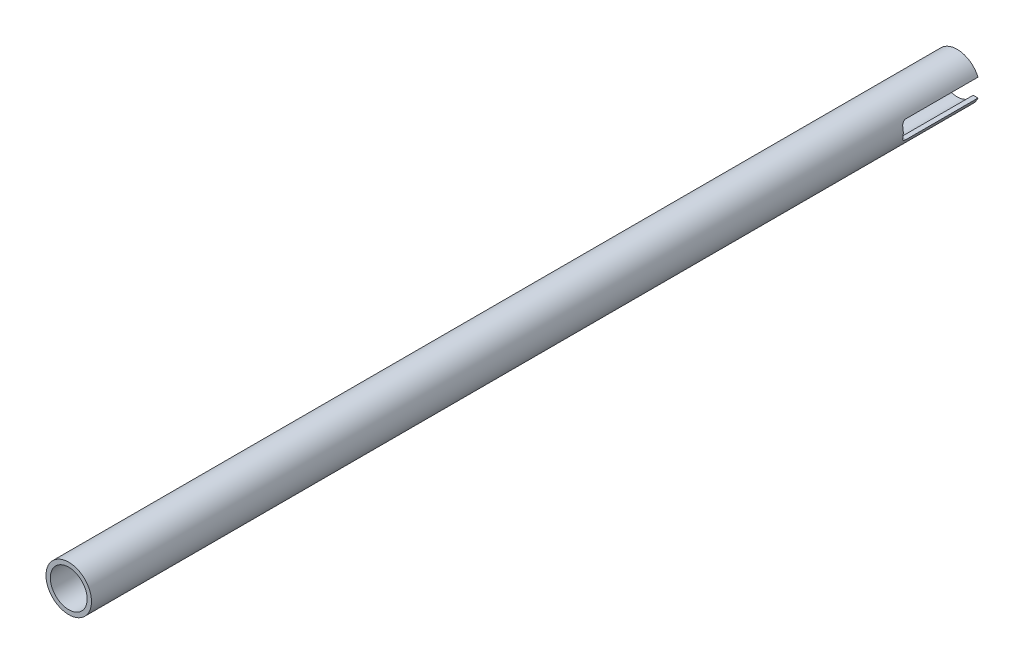
ISO-10303-21;
HEADER;
FILE_DESCRIPTION(('STEP AP214'),'2;1');
FILE_NAME('part.step','',(''),(''),'','','');
FILE_SCHEMA(('AUTOMOTIVE_DESIGN { 1 0 10303 214 1 1 1 1 }'));
ENDSEC;
DATA;
#1=APPLICATION_CONTEXT('core data for automotive mechanical design processes');
#2=APPLICATION_PROTOCOL_DEFINITION('international standard','automotive_design',2000,#1);
#3=PRODUCT_CONTEXT('',#1,'mechanical');
#4=PRODUCT('Part','Part','',(#3));
#5=PRODUCT_RELATED_PRODUCT_CATEGORY('part','',(#4));
#6=PRODUCT_DEFINITION_FORMATION('','',#4);
#7=PRODUCT_DEFINITION_CONTEXT('part definition',#1,'design');
#8=PRODUCT_DEFINITION('design','',#6,#7);
#9=PRODUCT_DEFINITION_SHAPE('','',#8);
#10=(LENGTH_UNIT() NAMED_UNIT(*) SI_UNIT(.MILLI.,.METRE.));
#11=(NAMED_UNIT(*) PLANE_ANGLE_UNIT() SI_UNIT($,.RADIAN.));
#12=(NAMED_UNIT(*) SI_UNIT($,.STERADIAN.) SOLID_ANGLE_UNIT());
#13=UNCERTAINTY_MEASURE_WITH_UNIT(LENGTH_MEASURE(1.E-05),#10,'distance_accuracy_value','');
#14=(GEOMETRIC_REPRESENTATION_CONTEXT(3) GLOBAL_UNCERTAINTY_ASSIGNED_CONTEXT((#13)) GLOBAL_UNIT_ASSIGNED_CONTEXT((#10,
#11,#12)) REPRESENTATION_CONTEXT('',''));
#15=CARTESIAN_POINT('',(0.,0.,0.));
#16=DIRECTION('',(0.,0.,1.));
#17=DIRECTION('',(1.,0.,0.));
#18=AXIS2_PLACEMENT_3D('',#15,#16,#17);
#19=CARTESIAN_POINT('',(0.,0.,0.));
#20=DIRECTION('',(0.,0.,1.));
#21=DIRECTION('',(1.,0.,0.));
#22=AXIS2_PLACEMENT_3D('',#19,#20,#21);
#23=PLANE('',#22);
#24=DIRECTION('',(-1.,0.,0.));
#25=VECTOR('',#24,1.);
#26=CARTESIAN_POINT('',(401.549427926421,-3.17500000000001,0.));
#27=LINE('',#26,#25);
#28=CARTESIAN_POINT('',(7.34407080575888,-3.17500000000001,0.));
#29=VERTEX_POINT('',#28);
#30=CARTESIAN_POINT('',(5.64543213580679,-3.17500000000001,0.));
#31=VERTEX_POINT('',#30);
#32=EDGE_CURVE('E57',#29,#31,#27,.T.);
#33=ORIENTED_EDGE('',*,*,#32,.F.);
#34=CARTESIAN_POINT('',(0.,0.,0.));
#35=DIRECTION('',(0.,0.,1.));
#36=DIRECTION('',(1.,0.,0.));
#37=AXIS2_PLACEMENT_3D('',#34,#35,#36);
#38=CIRCLE('',#37,8.001);
#39=CARTESIAN_POINT('',(-7.34407080575888,-3.17500000000001,0.));
#40=VERTEX_POINT('',#39);
#41=EDGE_CURVE('E146',#40,#29,#38,.T.);
#42=ORIENTED_EDGE('',*,*,#41,.F.);
#43=CARTESIAN_POINT('',(-5.64543213580676,-3.17500000000001,0.));
#44=VERTEX_POINT('',#43);
#45=EDGE_CURVE('E140',#44,#40,#27,.T.);
#46=ORIENTED_EDGE('',*,*,#45,.F.);
#47=CARTESIAN_POINT('',(0.,0.,0.));
#48=DIRECTION('',(0.,0.,1.));
#49=DIRECTION('',(1.,0.,0.));
#50=AXIS2_PLACEMENT_3D('',#47,#48,#49);
#51=CIRCLE('',#50,6.477);
#52=EDGE_CURVE('E242',#44,#31,#51,.T.);
#53=ORIENTED_EDGE('',*,*,#52,.T.);
#54=EDGE_LOOP('',(#33,#42,#46,#53));
#55=FACE_BOUND('',#54,.T.);
#56=ADVANCED_FACE('F33',(#55),#23,.F.);
#57=CARTESIAN_POINT('',(0.,0.,312.42));
#58=DIRECTION('',(0.,0.,-1.));
#59=DIRECTION('',(-1.,0.,0.));
#60=AXIS2_PLACEMENT_3D('',#57,#58,#59);
#61=CYLINDRICAL_SURFACE('',#60,8.001);
#62=CARTESIAN_POINT('',(0.,0.,312.42));
#63=DIRECTION('',(0.,0.,1.));
#64=DIRECTION('',(1.,0.,0.));
#65=AXIS2_PLACEMENT_3D('',#62,#63,#64);
#66=CIRCLE('',#65,8.001);
#67=CARTESIAN_POINT('',(8.001,0.,312.42));
#68=VERTEX_POINT('',#67);
#69=EDGE_CURVE('E249',#68,#68,#66,.T.);
#70=ORIENTED_EDGE('',*,*,#69,.F.);
#71=EDGE_LOOP('',(#70));
#72=FACE_BOUND('',#71,.T.);
#73=DIRECTION('',(0.,0.,-1.));
#74=VECTOR('',#73,1.);
#75=CARTESIAN_POINT('',(7.34407080575893,3.17499999999989,312.42));
#76=LINE('',#75,#74);
#77=CARTESIAN_POINT('',(7.34407080575894,3.175,0.));
#78=VERTEX_POINT('',#77);
#79=CARTESIAN_POINT('',(7.34407080575889,3.17499999999999,25.4));
#80=VERTEX_POINT('',#79);
#81=EDGE_CURVE('E238',#78,#80,#76,.F.);
#82=ORIENTED_EDGE('',*,*,#81,.F.);
#83=CARTESIAN_POINT('',(-7.34407080575894,3.175,0.));
#84=VERTEX_POINT('',#83);
#85=EDGE_CURVE('E253',#78,#84,#38,.T.);
#86=ORIENTED_EDGE('',*,*,#85,.T.);
#87=DIRECTION('',(0.,0.,-1.));
#88=VECTOR('',#87,1.);
#89=CARTESIAN_POINT('',(-7.34407080575893,3.17499999999989,312.42));
#90=LINE('',#89,#88);
#91=CARTESIAN_POINT('',(-7.34407080575889,3.17499999999999,25.4));
#92=VERTEX_POINT('',#91);
#93=EDGE_CURVE('E240',#92,#84,#90,.T.);
#94=ORIENTED_EDGE('',*,*,#93,.F.);
#95=CARTESIAN_POINT('',(-7.8288057837706,1.65099999999999,26.924));
#96=CARTESIAN_POINT('',(-7.81947795268345,1.69524181564514,26.9239996807889));
#97=CARTESIAN_POINT('',(-7.80977555287386,1.73937906238704,26.9220725755956));
#98=CARTESIAN_POINT('',(-7.7897053190962,1.82715995012294,26.9144259194222));
#99=CARTESIAN_POINT('',(-7.77933765259943,1.870803712116,26.9087073195399));
#100=CARTESIAN_POINT('',(-7.74740781787862,2.00038689143379,26.8859920832168));
#101=CARTESIAN_POINT('',(-7.72497172734663,2.08520038066885,26.8634353611242));
#102=CARTESIAN_POINT('',(-7.67879255624773,2.24931803273243,26.8043529357356));
#103=CARTESIAN_POINT('',(-7.65505009243317,2.32862475603218,26.767833776622));
#104=CARTESIAN_POINT('',(-7.60739952527334,2.47987144136615,26.6818403935313));
#105=CARTESIAN_POINT('',(-7.58349136309819,2.55180862700726,26.6323613118312));
#106=CARTESIAN_POINT('',(-7.53640113822511,2.68773877112478,26.5205553900397));
#107=CARTESIAN_POINT('',(-7.51324222932275,2.75155008701076,26.4579974672164));
#108=CARTESIAN_POINT('',(-7.46969556535498,2.86766507697725,26.3221080561482));
#109=CARTESIAN_POINT('',(-7.44930787514765,2.91996848174228,26.2487763158346));
#110=CARTESIAN_POINT('',(-7.41339882631975,3.00995182097469,26.095356056821));
#111=CARTESIAN_POINT('',(-7.39775949227146,3.04799299625044,26.015507568052));
#112=CARTESIAN_POINT('',(-7.37198636942665,3.10981595853761,25.8496963126839));
#113=CARTESIAN_POINT('',(-7.36184321814924,3.13362200161646,25.7637442276388));
#114=CARTESIAN_POINT('',(-7.35134082404798,3.15814271182933,25.630748149592));
#115=CARTESIAN_POINT('',(-7.34862226710174,3.16445643648463,25.5848527548858));
#116=CARTESIAN_POINT('',(-7.34498545577234,3.17288497032065,25.4926477775769));
#117=CARTESIAN_POINT('',(-7.34406565426136,3.17500338794749,25.4463385853611));
#118=CARTESIAN_POINT('',(-7.34407080575889,3.17499999999999,25.4));
#119=B_SPLINE_CURVE_WITH_KNOTS('',3,(#95,#96,#97,#98,#99,#100,#101,#102,#103,#104,#105,#106,
#107,#108,#109,#110,#111,#112,#113,#114,#115,#116,#117,#118),.UNSPECIFIED.,.F.,.F.,(4,2,2,2,2,2,
2,2,2,2,2,4),(0.,0.135553024626245,0.271072058592374,0.541437670457961,0.811676717226673,
1.082017202076,1.35761362878683,1.63321650449497,1.90127196271359,2.16886935439238,
2.30789050122071,2.4467920218655),.UNSPECIFIED.);
#120=CARTESIAN_POINT('',(-7.8288057837706,1.65099999999999,26.924));
#121=VERTEX_POINT('',#120);
#122=EDGE_CURVE('E226',#121,#92,#119,.T.);
#123=ORIENTED_EDGE('',*,*,#122,.F.);
#124=CARTESIAN_POINT('',(0.,0.,26.924));
#125=DIRECTION('',(0.,0.,-1.));
#126=DIRECTION('',(-1.,0.,0.));
#127=AXIS2_PLACEMENT_3D('',#124,#125,#126);
#128=CIRCLE('',#127,8.001);
#129=CARTESIAN_POINT('',(-7.8288057837706,-1.65100000000001,26.924));
#130=VERTEX_POINT('',#129);
#131=EDGE_CURVE('E134',#130,#121,#128,.T.);
#132=ORIENTED_EDGE('',*,*,#131,.F.);
#133=CARTESIAN_POINT('',(-7.34407080575888,-3.17500000000001,25.4));
#134=CARTESIAN_POINT('',(-7.3440680096913,-3.17500157818639,25.4406984476088));
#135=CARTESIAN_POINT('',(-7.34477630214677,-3.17336860893187,25.4813759502433));
#136=CARTESIAN_POINT('',(-7.34758309143992,-3.16686635956913,25.562411407968));
#137=CARTESIAN_POINT('',(-7.34968118035477,-3.16199802907896,25.6027694533067));
#138=CARTESIAN_POINT('',(-7.35798857580184,-3.14264423927033,25.7226338560667));
#139=CARTESIAN_POINT('',(-7.36621159330718,-3.12340930879257,25.8012906881812));
#140=CARTESIAN_POINT('',(-7.38735918413182,-3.07305366060584,25.9538993996992));
#141=CARTESIAN_POINT('',(-7.40028060607282,-3.0419409090553,26.027854393813));
#142=CARTESIAN_POINT('',(-7.4298815779994,-2.96890708335138,26.1694453435949));
#143=CARTESIAN_POINT('',(-7.44656372650464,-2.92697853298673,26.2370768840646));
#144=CARTESIAN_POINT('',(-7.48338951433548,-2.83153727514408,26.3673193992744));
#145=CARTESIAN_POINT('',(-7.5036517696014,-2.77760154335606,26.4295861247467));
#146=CARTESIAN_POINT('',(-7.54586923311684,-2.66077336101834,26.5443978381578));
#147=CARTESIAN_POINT('',(-7.56782510086072,-2.59787741319581,26.5969390116058));
#148=CARTESIAN_POINT('',(-7.61377353576087,-2.46009532987572,26.69442490565));
#149=CARTESIAN_POINT('',(-7.63780327629239,-2.38468542927396,26.738613263246));
#150=CARTESIAN_POINT('',(-7.68517828309943,-2.22728162943213,26.8135295949975));
#151=CARTESIAN_POINT('',(-7.70852388215322,-2.14529100625114,26.8442642181981));
#152=CARTESIAN_POINT('',(-7.74866065435345,-1.99473307846589,26.8863269168587));
#153=CARTESIAN_POINT('',(-7.76579152458538,-1.9270088220366,26.9003889784846));
#154=CARTESIAN_POINT('',(-7.79853598216448,-1.78994063052703,26.9192336722557));
#155=CARTESIAN_POINT('',(-7.81414985826825,-1.7205970068191,26.9240180736839));
#156=CARTESIAN_POINT('',(-7.8288057837706,-1.65100000000001,26.924));
#157=B_SPLINE_CURVE_WITH_KNOTS('',3,(#133,#134,#135,#136,#137,#138,#139,#140,#141,#142,#143,
#144,#145,#146,#147,#148,#149,#150,#151,#152,#153,#154,#155,#156),.UNSPECIFIED.,.F.,.F.,(4,2,2,
2,2,2,2,2,2,2,2,4),(0.,0.12201561431295,0.243995431359554,0.486888996424004,0.729619944201783,
0.972519126749111,1.22593711832599,1.47945429417213,1.75015649231413,2.02072475374975,
2.23388433321154,2.44700325838137),.UNSPECIFIED.);
#158=CARTESIAN_POINT('',(-7.34407080575888,-3.17500000000001,25.4));
#159=VERTEX_POINT('',#158);
#160=EDGE_CURVE('E135',#159,#130,#157,.T.);
#161=ORIENTED_EDGE('',*,*,#160,.F.);
#162=DIRECTION('',(0.,0.,-1.));
#163=VECTOR('',#162,1.);
#164=CARTESIAN_POINT('',(-7.34407080575888,-3.17500000000001,312.42));
#165=LINE('',#164,#163);
#166=EDGE_CURVE('E147',#40,#159,#165,.F.);
#167=ORIENTED_EDGE('',*,*,#166,.F.);
#168=ORIENTED_EDGE('',*,*,#41,.T.);
#169=DIRECTION('',(0.,0.,-1.));
#170=VECTOR('',#169,1.);
#171=CARTESIAN_POINT('',(7.34407080575888,-3.17500000000001,312.42));
#172=LINE('',#171,#170);
#173=CARTESIAN_POINT('',(7.34407080575888,-3.17500000000001,25.4));
#174=VERTEX_POINT('',#173);
#175=EDGE_CURVE('E138',#174,#29,#172,.T.);
#176=ORIENTED_EDGE('',*,*,#175,.F.);
#177=CARTESIAN_POINT('',(7.8288057837706,-1.65100000000001,26.924));
#178=CARTESIAN_POINT('',(7.81947795268344,-1.69524181564516,26.9239996807889));
#179=CARTESIAN_POINT('',(7.80977555287386,-1.73937906238705,26.9220725755956));
#180=CARTESIAN_POINT('',(7.78970531909619,-1.82715995012296,26.9144259194222));
#181=CARTESIAN_POINT('',(7.77933765259943,-1.87080371211602,26.9087073195399));
#182=CARTESIAN_POINT('',(7.74740781787862,-2.00038689143381,26.8859920832168));
#183=CARTESIAN_POINT('',(7.72497172734662,-2.08520038066886,26.8634353611242));
#184=CARTESIAN_POINT('',(7.67879255624773,-2.24931803273245,26.8043529357356));
#185=CARTESIAN_POINT('',(7.65505009243317,-2.3286247560322,26.767833776622));
#186=CARTESIAN_POINT('',(7.60739952527334,-2.47987144136616,26.6818403935313));
#187=CARTESIAN_POINT('',(7.58349136309818,-2.55180862700728,26.6323613118312));
#188=CARTESIAN_POINT('',(7.5364011382251,-2.6877387711248,26.5205553900397));
#189=CARTESIAN_POINT('',(7.51324222932275,-2.75155008701078,26.4579974672164));
#190=CARTESIAN_POINT('',(7.46969556535497,-2.86766507697726,26.3221080561482));
#191=CARTESIAN_POINT('',(7.44930787514765,-2.9199684817423,26.2487763158346));
#192=CARTESIAN_POINT('',(7.41339882631974,-3.00995182097471,26.095356056821));
#193=CARTESIAN_POINT('',(7.39775949227145,-3.04799299625045,26.015507568052));
#194=CARTESIAN_POINT('',(7.37198636942665,-3.10981595853763,25.8496963126839));
#195=CARTESIAN_POINT('',(7.36184321814923,-3.13362200161648,25.7637442276388));
#196=CARTESIAN_POINT('',(7.35134082404797,-3.15814271182935,25.630748149592));
#197=CARTESIAN_POINT('',(7.34862226710173,-3.16445643648465,25.5848527548858));
#198=CARTESIAN_POINT('',(7.34498545577233,-3.17288497032067,25.4926477775769));
#199=CARTESIAN_POINT('',(7.34406565426135,-3.17500338794751,25.4463385853611));
#200=CARTESIAN_POINT('',(7.34407080575888,-3.17500000000001,25.4));
#201=B_SPLINE_CURVE_WITH_KNOTS('',3,(#177,#178,#179,#180,#181,#182,#183,#184,#185,#186,#187,
#188,#189,#190,#191,#192,#193,#194,#195,#196,#197,#198,#199,#200),.UNSPECIFIED.,.F.,.F.,(4,2,2,
2,2,2,2,2,2,2,2,4),(0.,0.135553024626244,0.271072058592373,0.541437670457961,0.811676717226673,
1.082017202076,1.35761362878683,1.63321650449497,1.90127196271359,2.16886935439238,
2.3078905012207,2.4467920218655),.UNSPECIFIED.);
#202=CARTESIAN_POINT('',(7.8288057837706,-1.65100000000001,26.924));
#203=VERTEX_POINT('',#202);
#204=EDGE_CURVE('E124',#203,#174,#201,.T.);
#205=ORIENTED_EDGE('',*,*,#204,.F.);
#206=CARTESIAN_POINT('',(7.8288057837706,1.65099999999999,26.924));
#207=VERTEX_POINT('',#206);
#208=EDGE_CURVE('E232',#207,#203,#128,.T.);
#209=ORIENTED_EDGE('',*,*,#208,.F.);
#210=CARTESIAN_POINT('',(7.34407080575889,3.17499999999999,25.4));
#211=CARTESIAN_POINT('',(7.34406800969131,3.17500157818637,25.4406984476088));
#212=CARTESIAN_POINT('',(7.34477630214678,3.17336860893186,25.4813759502433));
#213=CARTESIAN_POINT('',(7.34758309143993,3.16686635956911,25.562411407968));
#214=CARTESIAN_POINT('',(7.34968118035478,3.16199802907895,25.6027694533067));
#215=CARTESIAN_POINT('',(7.35798857580184,3.14264423927032,25.7226338560667));
#216=CARTESIAN_POINT('',(7.36621159330719,3.12340930879256,25.8012906881812));
#217=CARTESIAN_POINT('',(7.38735918413182,3.07305366060582,25.9538993996992));
#218=CARTESIAN_POINT('',(7.40028060607282,3.04194090905528,26.027854393813));
#219=CARTESIAN_POINT('',(7.4298815779994,2.96890708335136,26.1694453435949));
#220=CARTESIAN_POINT('',(7.44656372650465,2.92697853298671,26.2370768840646));
#221=CARTESIAN_POINT('',(7.48338951433549,2.83153727514406,26.3673193992745));
#222=CARTESIAN_POINT('',(7.50365176960141,2.77760154335604,26.4295861247467));
#223=CARTESIAN_POINT('',(7.54586923311684,2.66077336101832,26.5443978381578));
#224=CARTESIAN_POINT('',(7.56782510086072,2.5978774131958,26.5969390116058));
#225=CARTESIAN_POINT('',(7.61377353576087,2.4600953298757,26.69442490565));
#226=CARTESIAN_POINT('',(7.6378032762924,2.38468542927395,26.738613263246));
#227=CARTESIAN_POINT('',(7.68517828309944,2.22728162943211,26.8135295949975));
#228=CARTESIAN_POINT('',(7.70852388215323,2.14529100625113,26.8442642181981));
#229=CARTESIAN_POINT('',(7.74866065435345,1.99473307846587,26.8863269168587));
#230=CARTESIAN_POINT('',(7.76579152458538,1.92700882203658,26.9003889784846));
#231=CARTESIAN_POINT('',(7.79853598216448,1.78994063052701,26.9192336722557));
#232=CARTESIAN_POINT('',(7.81414985826825,1.72059700681908,26.9240180736839));
#233=CARTESIAN_POINT('',(7.8288057837706,1.65099999999999,26.924));
#234=B_SPLINE_CURVE_WITH_KNOTS('',3,(#210,#211,#212,#213,#214,#215,#216,#217,#218,#219,#220,
#221,#222,#223,#224,#225,#226,#227,#228,#229,#230,#231,#232,#233),.UNSPECIFIED.,.F.,.F.,(4,2,2,
2,2,2,2,2,2,2,2,4),(0.,0.12201561431295,0.243995431359554,0.486888996424004,0.729619944201783,
0.972519126749115,1.225937118326,1.47945429417213,1.75015649231413,2.02072475374975,
2.23388433321155,2.44700325838137),.UNSPECIFIED.);
#235=EDGE_CURVE('E231',#80,#207,#234,.T.);
#236=ORIENTED_EDGE('',*,*,#235,.F.);
#237=EDGE_LOOP('',(#82,#86,#94,#123,#132,#161,#167,#168,#176,#205,#209,#236));
#238=FACE_BOUND('',#237,.T.);
#239=ADVANCED_FACE('F35',(#72,#238),#61,.T.);
#240=CARTESIAN_POINT('',(0.,0.,312.42));
#241=DIRECTION('',(0.,0.,-1.));
#242=DIRECTION('',(-1.,0.,0.));
#243=AXIS2_PLACEMENT_3D('',#240,#241,#242);
#244=CYLINDRICAL_SURFACE('',#243,6.477);
#245=CARTESIAN_POINT('',(0.,0.,312.42));
#246=DIRECTION('',(0.,0.,1.));
#247=DIRECTION('',(1.,0.,0.));
#248=AXIS2_PLACEMENT_3D('',#245,#246,#247);
#249=CIRCLE('',#248,6.477);
#250=CARTESIAN_POINT('',(6.477,0.,312.42));
#251=VERTEX_POINT('',#250);
#252=EDGE_CURVE('E243',#251,#251,#249,.T.);
#253=ORIENTED_EDGE('',*,*,#252,.T.);
#254=EDGE_LOOP('',(#253));
#255=FACE_BOUND('',#254,.T.);
#256=CARTESIAN_POINT('',(5.64543213580687,3.175,0.));
#257=VERTEX_POINT('',#256);
#258=CARTESIAN_POINT('',(-5.64543213580687,3.175,0.));
#259=VERTEX_POINT('',#258);
#260=EDGE_CURVE('E246',#257,#259,#51,.T.);
#261=ORIENTED_EDGE('',*,*,#260,.F.);
#262=DIRECTION('',(0.,0.,-1.));
#263=VECTOR('',#262,1.);
#264=CARTESIAN_POINT('',(5.64543213580685,3.17499999999989,312.42));
#265=LINE('',#264,#263);
#266=CARTESIAN_POINT('',(5.64543213580679,3.17499999999999,25.4));
#267=VERTEX_POINT('',#266);
#268=EDGE_CURVE('E11',#257,#267,#265,.F.);
#269=ORIENTED_EDGE('',*,*,#268,.T.);
#270=CARTESIAN_POINT('',(5.64543213580679,3.17499999999999,25.4));
#271=CARTESIAN_POINT('',(5.64542798532432,3.17500253012491,25.4395022750384));
#272=CARTESIAN_POINT('',(5.64629676751123,3.17346305780188,25.4789831851797));
#273=CARTESIAN_POINT('',(5.64973489172762,3.16734010596934,25.557616333837));
#274=CARTESIAN_POINT('',(5.65230347216193,3.16275798971433,25.5967687115998));
#275=CARTESIAN_POINT('',(5.6624528235623,3.14457608288719,25.7129070155873));
#276=CARTESIAN_POINT('',(5.67247830845162,3.12653965087181,25.7890381879893));
#277=CARTESIAN_POINT('',(5.69814957474155,3.07950075965754,25.9366255007952));
#278=CARTESIAN_POINT('',(5.71378770060105,3.05051323473278,26.0080878532046));
#279=CARTESIAN_POINT('',(5.74949312759986,2.98267072120713,26.1450337996201));
#280=CARTESIAN_POINT('',(5.7695654342793,2.94380457356396,26.2105105176722));
#281=CARTESIAN_POINT('',(5.81427344287328,2.85454020484129,26.3383725064171));
#282=CARTESIAN_POINT('',(5.83912294015509,2.80355001313473,26.4002682413202));
#283=CARTESIAN_POINT('',(5.89090094280743,2.69305400468479,26.5149190340714));
#284=CARTESIAN_POINT('',(5.91783040535228,2.63354425646504,26.5676698468731));
#285=CARTESIAN_POINT('',(5.9754026920417,2.50037980782341,26.6683991647787));
#286=CARTESIAN_POINT('',(6.00613015030678,2.42589024924425,26.7152294493506));
#287=CARTESIAN_POINT('',(6.06685054178971,2.26977298542592,26.7954912659983));
#288=CARTESIAN_POINT('',(6.09684379767183,2.18814849062353,26.8289287868608));
#289=CARTESIAN_POINT('',(6.15068954263711,2.03135452128191,26.8777262918858));
#290=CARTESIAN_POINT('',(6.17481721444706,1.95685658409068,26.8949485076857));
#291=CARTESIAN_POINT('',(6.2208090046563,1.80539896583252,26.9181012531514));
#292=CARTESIAN_POINT('',(6.24267154884634,1.72843762073706,26.9240239790673));
#293=CARTESIAN_POINT('',(6.26304462701648,1.65099999999999,26.924));
#294=B_SPLINE_CURVE_WITH_KNOTS('',3,(#270,#271,#272,#273,#274,#275,#276,#277,#278,#279,#280,
#281,#282,#283,#284,#285,#286,#287,#288,#289,#290,#291,#292,#293),.UNSPECIFIED.,.F.,.F.,(4,2,2,
2,2,2,2,2,2,2,2,4),(0.,0.11842611788255,0.236799210795268,0.472172634307249,0.707226225252082,
0.942546525606806,1.19340365391803,1.44437691938388,1.72272641785955,2.00095130860679,
2.2406452178067,2.48050460661625),.UNSPECIFIED.);
#295=CARTESIAN_POINT('',(6.26304462701648,1.65099999999999,26.924));
#296=VERTEX_POINT('',#295);
#297=EDGE_CURVE('E42',#267,#296,#294,.T.);
#298=ORIENTED_EDGE('',*,*,#297,.T.);
#299=CARTESIAN_POINT('',(0.,0.,26.924));
#300=DIRECTION('',(0.,0.,-1.));
#301=DIRECTION('',(-1.,0.,0.));
#302=AXIS2_PLACEMENT_3D('',#299,#300,#301);
#303=CIRCLE('',#302,6.477);
#304=CARTESIAN_POINT('',(6.26304462701648,-1.65100000000001,26.924));
#305=VERTEX_POINT('',#304);
#306=EDGE_CURVE('E189',#296,#305,#303,.T.);
#307=ORIENTED_EDGE('',*,*,#306,.T.);
#308=CARTESIAN_POINT('',(6.26304462701648,-1.65100000000001,26.924));
#309=CARTESIAN_POINT('',(6.25119301356599,-1.69597019045452,26.9239996512927));
#310=CARTESIAN_POINT('',(6.23885805015263,-1.74078424361484,26.9220087653986));
#311=CARTESIAN_POINT('',(6.21333080831812,-1.82980515275706,26.914134138941));
#312=CARTESIAN_POINT('',(6.20013884930389,-1.87401222760585,26.9082518413061));
#313=CARTESIAN_POINT('',(6.15951133396886,-2.00506101361784,26.8849457970163));
#314=CARTESIAN_POINT('',(6.13094979172369,-2.09061085165535,26.8618617467996));
#315=CARTESIAN_POINT('',(6.07212151471613,-2.25578612168244,26.8016219603263));
#316=CARTESIAN_POINT('',(6.04185654214358,-2.33541748531392,26.7644805465843));
#317=CARTESIAN_POINT('',(5.98100165398782,-2.48713337520254,26.6771532445204));
#318=CARTESIAN_POINT('',(5.95041151302896,-2.55921223237762,26.6269576544588));
#319=CARTESIAN_POINT('',(5.88959770370069,-2.69629003214929,26.5127307014112));
#320=CARTESIAN_POINT('',(5.85942026108732,-2.76097278644596,26.4482938275107));
#321=CARTESIAN_POINT('',(5.80262181829033,-2.87843237174364,26.3079375307773));
#322=CARTESIAN_POINT('',(5.77600068690932,-2.93120964200446,26.2320185317567));
#323=CARTESIAN_POINT('',(5.72961508062245,-3.02084256755071,26.0738173863488));
#324=CARTESIAN_POINT('',(5.70961192114585,-3.05826802843452,25.9919300118511));
#325=CARTESIAN_POINT('',(5.67705818777086,-3.11828924116529,25.8215909438744));
#326=CARTESIAN_POINT('',(5.66448853762436,-3.14092296814996,25.7331567140417));
#327=CARTESIAN_POINT('',(5.65274801817815,-3.16196375608022,25.603042864781));
#328=CARTESIAN_POINT('',(5.65001234622036,-3.16684526064363,25.5626313476031));
#329=CARTESIAN_POINT('',(5.64635324825543,-3.17336296637714,25.4814890576694));
#330=CARTESIAN_POINT('',(5.64542881846813,-3.17500096508517,25.440758474312));
#331=CARTESIAN_POINT('',(5.64543213580678,-3.17500000000001,25.4));
#332=B_SPLINE_CURVE_WITH_KNOTS('',3,(#308,#309,#310,#311,#312,#313,#314,#315,#316,#317,#318,
#319,#320,#321,#322,#323,#324,#325,#326,#327,#328,#329,#330,#331),.UNSPECIFIED.,.F.,.F.,(4,2,2,
2,2,2,2,2,2,2,2,4),(0.,0.13941997674178,0.278788285754549,0.556665652257206,0.8342606588877,
1.11206256399923,1.39912695233711,1.68618074753331,1.9613229485987,2.23575596690122,
2.35800176569004,2.48017979736539),.UNSPECIFIED.);
#333=CARTESIAN_POINT('',(5.64543213580676,-3.17500000000001,25.4));
#334=VERTEX_POINT('',#333);
#335=EDGE_CURVE('E183',#305,#334,#332,.T.);
#336=ORIENTED_EDGE('',*,*,#335,.T.);
#337=DIRECTION('',(0.,0.,-1.));
#338=VECTOR('',#337,1.);
#339=CARTESIAN_POINT('',(5.64543213580679,-3.17500000000001,312.42));
#340=LINE('',#339,#338);
#341=EDGE_CURVE('E139',#334,#31,#340,.T.);
#342=ORIENTED_EDGE('',*,*,#341,.T.);
#343=ORIENTED_EDGE('',*,*,#52,.F.);
#344=DIRECTION('',(0.,0.,-1.));
#345=VECTOR('',#344,1.);
#346=CARTESIAN_POINT('',(-5.64543213580679,-3.17500000000001,312.42));
#347=LINE('',#346,#345);
#348=CARTESIAN_POINT('',(-5.64543213580679,-3.17500000000001,25.4));
#349=VERTEX_POINT('',#348);
#350=EDGE_CURVE('E252',#44,#349,#347,.F.);
#351=ORIENTED_EDGE('',*,*,#350,.T.);
#352=CARTESIAN_POINT('',(-5.64543213580678,-3.17500000000001,25.4));
#353=CARTESIAN_POINT('',(-5.64542798532431,-3.17500253012492,25.4395022750384));
#354=CARTESIAN_POINT('',(-5.64629676751122,-3.1734630578019,25.4789831851797));
#355=CARTESIAN_POINT('',(-5.64973489172761,-3.16734010596936,25.557616333837));
#356=CARTESIAN_POINT('',(-5.65230347216192,-3.16275798971435,25.5967687115998));
#357=CARTESIAN_POINT('',(-5.6624528235623,-3.1445760828872,25.7129070155873));
#358=CARTESIAN_POINT('',(-5.67247830845161,-3.12653965087182,25.7890381879893));
#359=CARTESIAN_POINT('',(-5.69814957474154,-3.07950075965756,25.9366255007952));
#360=CARTESIAN_POINT('',(-5.71378770060104,-3.05051323473279,26.0080878532046));
#361=CARTESIAN_POINT('',(-5.74949312759985,-2.98267072120715,26.1450337996201));
#362=CARTESIAN_POINT('',(-5.76956543427929,-2.94380457356397,26.2105105176722));
#363=CARTESIAN_POINT('',(-5.81427344287327,-2.8545402048413,26.3383725064171));
#364=CARTESIAN_POINT('',(-5.83912294015508,-2.80355001313475,26.4002682413202));
#365=CARTESIAN_POINT('',(-5.89090094280742,-2.69305400468481,26.5149190340714));
#366=CARTESIAN_POINT('',(-5.91783040535227,-2.63354425646506,26.5676698468731));
#367=CARTESIAN_POINT('',(-5.97540269204169,-2.50037980782343,26.6683991647787));
#368=CARTESIAN_POINT('',(-6.00613015030677,-2.42589024924427,26.7152294493506));
#369=CARTESIAN_POINT('',(-6.0668505417897,-2.26977298542594,26.7954912659983));
#370=CARTESIAN_POINT('',(-6.09684379767182,-2.18814849062354,26.8289287868608));
#371=CARTESIAN_POINT('',(-6.1506895426371,-2.03135452128192,26.8777262918858));
#372=CARTESIAN_POINT('',(-6.17481721444705,-1.95685658409069,26.8949485076857));
#373=CARTESIAN_POINT('',(-6.22080900465629,-1.80539896583253,26.9181012531514));
#374=CARTESIAN_POINT('',(-6.24267154884634,-1.72843762073708,26.9240239790673));
#375=CARTESIAN_POINT('',(-6.26304462701648,-1.65100000000001,26.924));
#376=B_SPLINE_CURVE_WITH_KNOTS('',3,(#352,#353,#354,#355,#356,#357,#358,#359,#360,#361,#362,
#363,#364,#365,#366,#367,#368,#369,#370,#371,#372,#373,#374,#375),.UNSPECIFIED.,.F.,.F.,(4,2,2,
2,2,2,2,2,2,2,2,4),(0.,0.11842611788255,0.236799210795268,0.472172634307249,0.707226225252082,
0.942546525606806,1.19340365391803,1.44437691938388,1.72272641785955,2.00095130860679,
2.2406452178067,2.48050460661626),.UNSPECIFIED.);
#377=CARTESIAN_POINT('',(-6.26304462701648,-1.65100000000001,26.924));
#378=VERTEX_POINT('',#377);
#379=EDGE_CURVE('E173',#349,#378,#376,.T.);
#380=ORIENTED_EDGE('',*,*,#379,.T.);
#381=CARTESIAN_POINT('',(-6.26304462701648,1.65099999999999,26.924));
#382=VERTEX_POINT('',#381);
#383=EDGE_CURVE('E214',#378,#382,#303,.T.);
#384=ORIENTED_EDGE('',*,*,#383,.T.);
#385=CARTESIAN_POINT('',(-6.26304462701648,1.65099999999999,26.924));
#386=CARTESIAN_POINT('',(-6.25119301356599,1.6959701904545,26.9239996512927));
#387=CARTESIAN_POINT('',(-6.23885805015264,1.74078424361483,26.9220087653986));
#388=CARTESIAN_POINT('',(-6.21333080831813,1.82980515275704,26.914134138941));
#389=CARTESIAN_POINT('',(-6.20013884930389,1.87401222760583,26.9082518413061));
#390=CARTESIAN_POINT('',(-6.15951133396887,2.00506101361782,26.8849457970163));
#391=CARTESIAN_POINT('',(-6.13094979172369,2.09061085165533,26.8618617467996));
#392=CARTESIAN_POINT('',(-6.07212151471614,2.25578612168242,26.8016219603263));
#393=CARTESIAN_POINT('',(-6.04185654214358,2.3354174853139,26.7644805465843));
#394=CARTESIAN_POINT('',(-5.98100165398783,2.48713337520252,26.6771532445204));
#395=CARTESIAN_POINT('',(-5.95041151302897,2.5592122323776,26.6269576544588));
#396=CARTESIAN_POINT('',(-5.88959770370069,2.69629003214928,26.5127307014112));
#397=CARTESIAN_POINT('',(-5.85942026108733,2.76097278644594,26.4482938275107));
#398=CARTESIAN_POINT('',(-5.80262181829034,2.87843237174362,26.3079375307773));
#399=CARTESIAN_POINT('',(-5.77600068690933,2.93120964200444,26.2320185317567));
#400=CARTESIAN_POINT('',(-5.72961508062246,3.02084256755069,26.0738173863488));
#401=CARTESIAN_POINT('',(-5.70961192114586,3.0582680284345,25.9919300118511));
#402=CARTESIAN_POINT('',(-5.67705818777087,3.11828924116528,25.8215909438744));
#403=CARTESIAN_POINT('',(-5.66448853762436,3.14092296814994,25.7331567140417));
#404=CARTESIAN_POINT('',(-5.65274801817815,3.16196375608021,25.603042864781));
#405=CARTESIAN_POINT('',(-5.65001234622036,3.16684526064362,25.5626313476031));
#406=CARTESIAN_POINT('',(-5.64635324825543,3.17336296637713,25.4814890576694));
#407=CARTESIAN_POINT('',(-5.64542881846814,3.17500096508516,25.440758474312));
#408=CARTESIAN_POINT('',(-5.6454321358068,3.17499999999999,25.4));
#409=B_SPLINE_CURVE_WITH_KNOTS('',3,(#385,#386,#387,#388,#389,#390,#391,#392,#393,#394,#395,
#396,#397,#398,#399,#400,#401,#402,#403,#404,#405,#406,#407,#408),.UNSPECIFIED.,.F.,.F.,(4,2,2,
2,2,2,2,2,2,2,2,4),(0.,0.13941997674178,0.278788285754548,0.556665652257204,0.834260658887697,
1.11206256399923,1.39912695233711,1.68618074753331,1.96132294859869,2.23575596690122,
2.35800176569004,2.48017979736539),.UNSPECIFIED.);
#410=CARTESIAN_POINT('',(-5.64543213580679,3.17499999999999,25.4));
#411=VERTEX_POINT('',#410);
#412=EDGE_CURVE('E207',#382,#411,#409,.T.);
#413=ORIENTED_EDGE('',*,*,#412,.T.);
#414=DIRECTION('',(0.,0.,-1.));
#415=VECTOR('',#414,1.);
#416=CARTESIAN_POINT('',(-5.64543213580685,3.17499999999989,312.42));
#417=LINE('',#416,#415);
#418=EDGE_CURVE('E213',#411,#259,#417,.T.);
#419=ORIENTED_EDGE('',*,*,#418,.T.);
#420=EDGE_LOOP('',(#261,#269,#298,#307,#336,#342,#343,#351,#380,#384,#413,#419));
#421=FACE_BOUND('',#420,.T.);
#422=ADVANCED_FACE('F195',(#255,#421),#244,.F.);
#423=CARTESIAN_POINT('',(0.,0.,312.42));
#424=DIRECTION('',(0.,0.,1.));
#425=DIRECTION('',(1.,0.,0.));
#426=AXIS2_PLACEMENT_3D('',#423,#424,#425);
#427=PLANE('',#426);
#428=ORIENTED_EDGE('',*,*,#69,.T.);
#429=EDGE_LOOP('',(#428));
#430=FACE_BOUND('',#429,.T.);
#431=ORIENTED_EDGE('',*,*,#252,.F.);
#432=EDGE_LOOP('',(#431));
#433=FACE_BOUND('',#432,.T.);
#434=ADVANCED_FACE('F200',(#430,#433),#427,.T.);
#435=ORIENTED_EDGE('',*,*,#85,.F.);
#436=DIRECTION('',(-1.,0.,0.));
#437=VECTOR('',#436,1.);
#438=CARTESIAN_POINT('',(401.549427926421,3.175,0.));
#439=LINE('',#438,#437);
#440=EDGE_CURVE('E150',#78,#257,#439,.T.);
#441=ORIENTED_EDGE('',*,*,#440,.T.);
#442=ORIENTED_EDGE('',*,*,#260,.T.);
#443=EDGE_CURVE('E272',#259,#84,#439,.T.);
#444=ORIENTED_EDGE('',*,*,#443,.T.);
#445=EDGE_LOOP('',(#435,#441,#442,#444));
#446=FACE_BOUND('',#445,.T.);
#447=ADVANCED_FACE('F295',(#446),#23,.F.);
#448=CARTESIAN_POINT('',(401.549427926421,-3.17500000000001,25.4));
#449=DIRECTION('',(0.,1.,0.));
#450=DIRECTION('',(0.,0.,1.));
#451=AXIS2_PLACEMENT_3D('',#448,#449,#450);
#452=PLANE('',#451);
#453=ORIENTED_EDGE('',*,*,#45,.T.);
#454=ORIENTED_EDGE('',*,*,#166,.T.);
#455=DIRECTION('',(-1.,0.,0.));
#456=VECTOR('',#455,1.);
#457=CARTESIAN_POINT('',(401.549427926421,-3.17500000000001,25.4));
#458=LINE('',#457,#456);
#459=EDGE_CURVE('E49',#349,#159,#458,.T.);
#460=ORIENTED_EDGE('',*,*,#459,.F.);
#461=ORIENTED_EDGE('',*,*,#350,.F.);
#462=EDGE_LOOP('',(#453,#454,#460,#461));
#463=FACE_BOUND('',#462,.T.);
#464=ADVANCED_FACE('F285',(#463),#452,.T.);
#465=CARTESIAN_POINT('',(401.549427926421,-1.65100000000001,25.4));
#466=DIRECTION('',(-1.,0.,0.));
#467=DIRECTION('',(0.,0.,1.));
#468=AXIS2_PLACEMENT_3D('',#465,#466,#467);
#469=CYLINDRICAL_SURFACE('',#468,1.524);
#470=ORIENTED_EDGE('',*,*,#459,.T.);
#471=ORIENTED_EDGE('',*,*,#160,.T.);
#472=DIRECTION('',(-1.,0.,0.));
#473=VECTOR('',#472,1.);
#474=CARTESIAN_POINT('',(401.549427926421,-1.65100000000001,26.924));
#475=LINE('',#474,#473);
#476=EDGE_CURVE('E281',#378,#130,#475,.T.);
#477=ORIENTED_EDGE('',*,*,#476,.F.);
#478=ORIENTED_EDGE('',*,*,#379,.F.);
#479=EDGE_LOOP('',(#470,#471,#477,#478));
#480=FACE_BOUND('',#479,.T.);
#481=ADVANCED_FACE('F168',(#480),#469,.F.);
#482=CARTESIAN_POINT('',(401.549427926421,1.65099999999999,26.924));
#483=DIRECTION('',(0.,0.,-1.));
#484=DIRECTION('',(-1.,0.,0.));
#485=AXIS2_PLACEMENT_3D('',#482,#483,#484);
#486=PLANE('',#485);
#487=ORIENTED_EDGE('',*,*,#476,.T.);
#488=ORIENTED_EDGE('',*,*,#131,.T.);
#489=DIRECTION('',(-1.,0.,0.));
#490=VECTOR('',#489,1.);
#491=CARTESIAN_POINT('',(401.549427926421,1.65099999999999,26.924));
#492=LINE('',#491,#490);
#493=EDGE_CURVE('E278',#382,#121,#492,.T.);
#494=ORIENTED_EDGE('',*,*,#493,.F.);
#495=ORIENTED_EDGE('',*,*,#383,.F.);
#496=EDGE_LOOP('',(#487,#488,#494,#495));
#497=FACE_BOUND('',#496,.T.);
#498=ADVANCED_FACE('F300',(#497),#486,.T.);
#499=CARTESIAN_POINT('',(401.549427926421,1.65099999999999,25.4));
#500=DIRECTION('',(-1.,0.,0.));
#501=DIRECTION('',(0.,0.,1.));
#502=AXIS2_PLACEMENT_3D('',#499,#500,#501);
#503=CYLINDRICAL_SURFACE('',#502,1.524);
#504=ORIENTED_EDGE('',*,*,#493,.T.);
#505=ORIENTED_EDGE('',*,*,#122,.T.);
#506=DIRECTION('',(-1.,0.,0.));
#507=VECTOR('',#506,1.);
#508=CARTESIAN_POINT('',(401.549427926421,3.17499999999999,25.4));
#509=LINE('',#508,#507);
#510=EDGE_CURVE('E273',#411,#92,#509,.T.);
#511=ORIENTED_EDGE('',*,*,#510,.F.);
#512=ORIENTED_EDGE('',*,*,#412,.F.);
#513=EDGE_LOOP('',(#504,#505,#511,#512));
#514=FACE_BOUND('',#513,.T.);
#515=ADVANCED_FACE('F220',(#514),#503,.F.);
#516=CARTESIAN_POINT('',(401.549427926421,3.175,0.));
#517=DIRECTION('',(0.,-1.,0.));
#518=DIRECTION('',(0.,0.,-1.));
#519=AXIS2_PLACEMENT_3D('',#516,#517,#518);
#520=PLANE('',#519);
#521=ORIENTED_EDGE('',*,*,#510,.T.);
#522=ORIENTED_EDGE('',*,*,#93,.T.);
#523=ORIENTED_EDGE('',*,*,#443,.F.);
#524=ORIENTED_EDGE('',*,*,#418,.F.);
#525=EDGE_LOOP('',(#521,#522,#523,#524));
#526=FACE_BOUND('',#525,.T.);
#527=ADVANCED_FACE('F202',(#526),#520,.T.);
#528=ORIENTED_EDGE('',*,*,#440,.F.);
#529=ORIENTED_EDGE('',*,*,#81,.T.);
#530=EDGE_CURVE('E266',#80,#267,#509,.T.);
#531=ORIENTED_EDGE('',*,*,#530,.T.);
#532=ORIENTED_EDGE('',*,*,#268,.F.);
#533=EDGE_LOOP('',(#528,#529,#531,#532));
#534=FACE_BOUND('',#533,.T.);
#535=ADVANCED_FACE('F218',(#534),#520,.T.);
#536=ORIENTED_EDGE('',*,*,#530,.F.);
#537=ORIENTED_EDGE('',*,*,#235,.T.);
#538=EDGE_CURVE('E269',#207,#296,#492,.T.);
#539=ORIENTED_EDGE('',*,*,#538,.T.);
#540=ORIENTED_EDGE('',*,*,#297,.F.);
#541=EDGE_LOOP('',(#536,#537,#539,#540));
#542=FACE_BOUND('',#541,.T.);
#543=ADVANCED_FACE('F215',(#542),#503,.F.);
#544=ORIENTED_EDGE('',*,*,#538,.F.);
#545=ORIENTED_EDGE('',*,*,#208,.T.);
#546=EDGE_CURVE('E130',#203,#305,#475,.T.);
#547=ORIENTED_EDGE('',*,*,#546,.T.);
#548=ORIENTED_EDGE('',*,*,#306,.F.);
#549=EDGE_LOOP('',(#544,#545,#547,#548));
#550=FACE_BOUND('',#549,.T.);
#551=ADVANCED_FACE('F167',(#550),#486,.T.);
#552=ORIENTED_EDGE('',*,*,#546,.F.);
#553=ORIENTED_EDGE('',*,*,#204,.T.);
#554=EDGE_CURVE('E127',#174,#334,#458,.T.);
#555=ORIENTED_EDGE('',*,*,#554,.T.);
#556=ORIENTED_EDGE('',*,*,#335,.F.);
#557=EDGE_LOOP('',(#552,#553,#555,#556));
#558=FACE_BOUND('',#557,.T.);
#559=ADVANCED_FACE('F126',(#558),#469,.F.);
#560=ORIENTED_EDGE('',*,*,#554,.F.);
#561=ORIENTED_EDGE('',*,*,#175,.T.);
#562=ORIENTED_EDGE('',*,*,#32,.T.);
#563=ORIENTED_EDGE('',*,*,#341,.F.);
#564=EDGE_LOOP('',(#560,#561,#562,#563));
#565=FACE_BOUND('',#564,.T.);
#566=ADVANCED_FACE('F137',(#565),#452,.T.);
#567=CLOSED_SHELL('',(#56,#239,#422,#434,#447,#464,#481,#498,#515,#527,#535,#543,#551,#559,#566));
#568=MANIFOLD_SOLID_BREP('B2',#567);
#569=ADVANCED_BREP_SHAPE_REPRESENTATION('',(#18,#568),#14);
#570=SHAPE_DEFINITION_REPRESENTATION(#9,#569);
ENDSEC;
END-ISO-10303-21;
